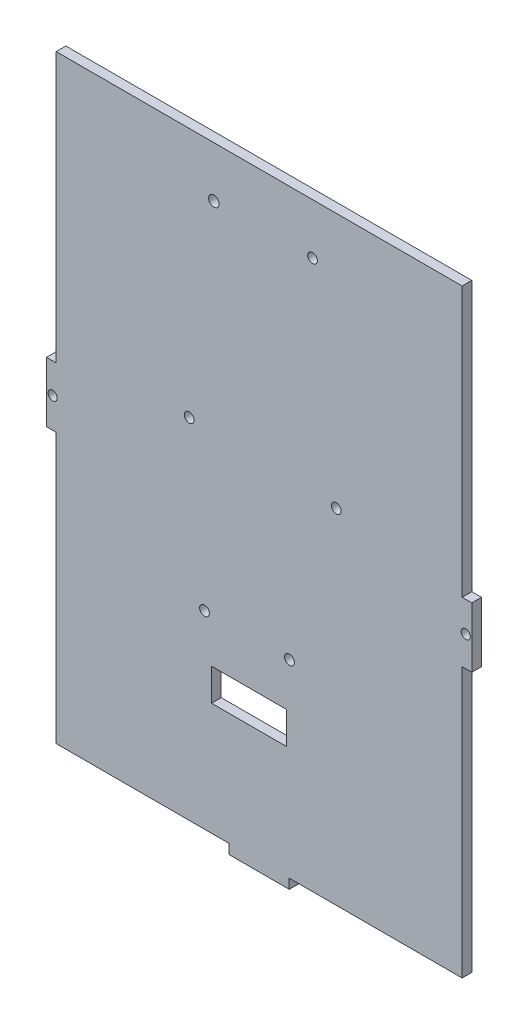
ISO-10303-21;
HEADER;
FILE_DESCRIPTION(('STEP AP214'),'2;1');
FILE_NAME('part.step','',(''),(''),'','','');
FILE_SCHEMA(('AUTOMOTIVE_DESIGN { 1 0 10303 214 1 1 1 1 }'));
ENDSEC;
DATA;
#1=APPLICATION_CONTEXT('core data for automotive mechanical design processes');
#2=APPLICATION_PROTOCOL_DEFINITION('international standard','automotive_design',2000,#1);
#3=PRODUCT_CONTEXT('',#1,'mechanical');
#4=PRODUCT('Part','Part','',(#3));
#5=PRODUCT_RELATED_PRODUCT_CATEGORY('part','',(#4));
#6=PRODUCT_DEFINITION_FORMATION('','',#4);
#7=PRODUCT_DEFINITION_CONTEXT('part definition',#1,'design');
#8=PRODUCT_DEFINITION('design','',#6,#7);
#9=PRODUCT_DEFINITION_SHAPE('','',#8);
#10=(LENGTH_UNIT() NAMED_UNIT(*) SI_UNIT(.MILLI.,.METRE.));
#11=(NAMED_UNIT(*) PLANE_ANGLE_UNIT() SI_UNIT($,.RADIAN.));
#12=(NAMED_UNIT(*) SI_UNIT($,.STERADIAN.) SOLID_ANGLE_UNIT());
#13=UNCERTAINTY_MEASURE_WITH_UNIT(LENGTH_MEASURE(1.E-05),#10,'distance_accuracy_value','');
#14=(GEOMETRIC_REPRESENTATION_CONTEXT(3) GLOBAL_UNCERTAINTY_ASSIGNED_CONTEXT((#13)) GLOBAL_UNIT_ASSIGNED_CONTEXT((#10,
#11,#12)) REPRESENTATION_CONTEXT('',''));
#15=CARTESIAN_POINT('',(0.,0.,0.));
#16=DIRECTION('',(0.,0.,1.));
#17=DIRECTION('',(1.,0.,0.));
#18=AXIS2_PLACEMENT_3D('',#15,#16,#17);
#19=CARTESIAN_POINT('',(69.85,101.6,3.18));
#20=DIRECTION('',(-1.,0.,0.));
#21=DIRECTION('',(0.,-1.,0.));
#22=AXIS2_PLACEMENT_3D('',#19,#20,#21);
#23=PLANE('',#22);
#24=DIRECTION('',(0.,1.,0.));
#25=VECTOR('',#24,1.);
#26=CARTESIAN_POINT('',(69.85,101.6,0.));
#27=LINE('',#26,#25);
#28=CARTESIAN_POINT('',(69.85,-9.875,0.));
#29=VERTEX_POINT('',#28);
#30=CARTESIAN_POINT('',(69.85,9.875,0.));
#31=VERTEX_POINT('',#30);
#32=EDGE_CURVE('E326',#29,#31,#27,.T.);
#33=ORIENTED_EDGE('',*,*,#32,.T.);
#34=DIRECTION('',(0.,0.,1.));
#35=VECTOR('',#34,1.);
#36=CARTESIAN_POINT('',(69.85,9.875,0.));
#37=LINE('',#36,#35);
#38=CARTESIAN_POINT('',(69.85,9.875,3.18));
#39=VERTEX_POINT('',#38);
#40=EDGE_CURVE('E349',#31,#39,#37,.T.);
#41=ORIENTED_EDGE('',*,*,#40,.T.);
#42=DIRECTION('',(0.,1.,0.));
#43=VECTOR('',#42,1.);
#44=CARTESIAN_POINT('',(69.85,101.6,3.18));
#45=LINE('',#44,#43);
#46=CARTESIAN_POINT('',(69.85,-9.875,3.18));
#47=VERTEX_POINT('',#46);
#48=EDGE_CURVE('E363',#47,#39,#45,.T.);
#49=ORIENTED_EDGE('',*,*,#48,.F.);
#50=DIRECTION('',(0.,0.,1.));
#51=VECTOR('',#50,1.);
#52=CARTESIAN_POINT('',(69.85,-9.875,0.));
#53=LINE('',#52,#51);
#54=EDGE_CURVE('E335',#29,#47,#53,.T.);
#55=ORIENTED_EDGE('',*,*,#54,.F.);
#56=EDGE_LOOP('',(#33,#41,#49,#55));
#57=FACE_BOUND('',#56,.T.);
#58=ADVANCED_FACE('F41',(#57),#23,.F.);
#59=CARTESIAN_POINT('',(-69.85,101.6,3.18));
#60=DIRECTION('',(1.,0.,0.));
#61=DIRECTION('',(0.,1.,0.));
#62=AXIS2_PLACEMENT_3D('',#59,#60,#61);
#63=PLANE('',#62);
#64=DIRECTION('',(0.,-1.,0.));
#65=VECTOR('',#64,1.);
#66=CARTESIAN_POINT('',(-69.85,101.6,3.18));
#67=LINE('',#66,#65);
#68=CARTESIAN_POINT('',(-69.85,9.875,3.18));
#69=VERTEX_POINT('',#68);
#70=CARTESIAN_POINT('',(-69.85,-9.875,3.18));
#71=VERTEX_POINT('',#70);
#72=EDGE_CURVE('E49',#69,#71,#67,.T.);
#73=ORIENTED_EDGE('',*,*,#72,.F.);
#74=DIRECTION('',(0.,0.,1.));
#75=VECTOR('',#74,1.);
#76=CARTESIAN_POINT('',(-69.85,9.875,0.));
#77=LINE('',#76,#75);
#78=CARTESIAN_POINT('',(-69.85,9.875,0.));
#79=VERTEX_POINT('',#78);
#80=EDGE_CURVE('E319',#79,#69,#77,.T.);
#81=ORIENTED_EDGE('',*,*,#80,.F.);
#82=DIRECTION('',(0.,-1.,0.));
#83=VECTOR('',#82,1.);
#84=CARTESIAN_POINT('',(-69.85,101.6,0.));
#85=LINE('',#84,#83);
#86=CARTESIAN_POINT('',(-69.85,-9.875,0.));
#87=VERTEX_POINT('',#86);
#88=EDGE_CURVE('E371',#79,#87,#85,.T.);
#89=ORIENTED_EDGE('',*,*,#88,.T.);
#90=DIRECTION('',(0.,0.,1.));
#91=VECTOR('',#90,1.);
#92=CARTESIAN_POINT('',(-69.85,-9.875,0.));
#93=LINE('',#92,#91);
#94=EDGE_CURVE('E300',#87,#71,#93,.T.);
#95=ORIENTED_EDGE('',*,*,#94,.T.);
#96=EDGE_LOOP('',(#73,#81,#89,#95));
#97=FACE_BOUND('',#96,.T.);
#98=ADVANCED_FACE('F433',(#97),#63,.F.);
#99=CARTESIAN_POINT('',(-69.85,-101.6,3.18));
#100=DIRECTION('',(0.,1.,0.));
#101=DIRECTION('',(0.,0.,1.));
#102=AXIS2_PLACEMENT_3D('',#99,#100,#101);
#103=PLANE('',#102);
#104=DIRECTION('',(1.,0.,0.));
#105=VECTOR('',#104,1.);
#106=CARTESIAN_POINT('',(-69.85,-101.6,3.18));
#107=LINE('',#106,#105);
#108=CARTESIAN_POINT('',(-9.87499999999999,-101.6,3.18));
#109=VERTEX_POINT('',#108);
#110=CARTESIAN_POINT('',(9.87500000000001,-101.6,3.18));
#111=VERTEX_POINT('',#110);
#112=EDGE_CURVE('E11',#109,#111,#107,.T.);
#113=ORIENTED_EDGE('',*,*,#112,.F.);
#114=DIRECTION('',(0.,0.,1.));
#115=VECTOR('',#114,1.);
#116=CARTESIAN_POINT('',(-9.87499999999999,-101.6,0.));
#117=LINE('',#116,#115);
#118=CARTESIAN_POINT('',(-9.87499999999999,-101.6,0.));
#119=VERTEX_POINT('',#118);
#120=EDGE_CURVE('E260',#119,#109,#117,.T.);
#121=ORIENTED_EDGE('',*,*,#120,.F.);
#122=DIRECTION('',(1.,0.,0.));
#123=VECTOR('',#122,1.);
#124=CARTESIAN_POINT('',(-69.85,-101.6,0.));
#125=LINE('',#124,#123);
#126=CARTESIAN_POINT('',(9.87500000000001,-101.6,0.));
#127=VERTEX_POINT('',#126);
#128=EDGE_CURVE('E366',#119,#127,#125,.T.);
#129=ORIENTED_EDGE('',*,*,#128,.T.);
#130=DIRECTION('',(0.,0.,1.));
#131=VECTOR('',#130,1.);
#132=CARTESIAN_POINT('',(9.87500000000001,-101.6,0.));
#133=LINE('',#132,#131);
#134=EDGE_CURVE('E264',#127,#111,#133,.T.);
#135=ORIENTED_EDGE('',*,*,#134,.T.);
#136=EDGE_LOOP('',(#113,#121,#129,#135));
#137=FACE_BOUND('',#136,.T.);
#138=ADVANCED_FACE('F393',(#137),#103,.F.);
#139=CARTESIAN_POINT('',(0.,0.,3.18));
#140=DIRECTION('',(0.,0.,1.));
#141=DIRECTION('',(1.,0.,0.));
#142=AXIS2_PLACEMENT_3D('',#139,#140,#141);
#143=PLANE('',#142);
#144=CARTESIAN_POINT('',(17.5238782385584,81.7973984042533,3.18));
#145=DIRECTION('',(0.,0.,1.));
#146=DIRECTION('',(1.,0.,0.));
#147=AXIS2_PLACEMENT_3D('',#144,#145,#146);
#148=CIRCLE('',#147,1.59000000000001);
#149=CARTESIAN_POINT('',(19.1138782385584,81.7973984042533,3.18));
#150=VERTEX_POINT('',#149);
#151=EDGE_CURVE('E377',#150,#150,#148,.T.);
#152=ORIENTED_EDGE('',*,*,#151,.F.);
#153=EDGE_LOOP('',(#152));
#154=FACE_BOUND('',#153,.T.);
#155=CARTESIAN_POINT('',(-14.8830919482617,81.7973984042533,3.18));
#156=DIRECTION('',(0.,0.,1.));
#157=DIRECTION('',(1.,0.,0.));
#158=AXIS2_PLACEMENT_3D('',#155,#156,#157);
#159=CIRCLE('',#158,1.71788268037511);
#160=CARTESIAN_POINT('',(-13.1652092678866,81.7973984042533,3.18));
#161=VERTEX_POINT('',#160);
#162=EDGE_CURVE('E203',#161,#161,#159,.T.);
#163=ORIENTED_EDGE('',*,*,#162,.F.);
#164=EDGE_LOOP('',(#163));
#165=FACE_BOUND('',#164,.T.);
#166=DIRECTION('',(0.,1.,0.));
#167=VECTOR('',#166,1.);
#168=CARTESIAN_POINT('',(8.92310875962821,-61.418139549545,3.18));
#169=LINE('',#168,#167);
#170=CARTESIAN_POINT('',(8.92310875962821,-61.418139549545,3.18));
#171=VERTEX_POINT('',#170);
#172=CARTESIAN_POINT('',(8.92310875962821,-50.8809258858847,3.18));
#173=VERTEX_POINT('',#172);
#174=EDGE_CURVE('E57',#171,#173,#169,.T.);
#175=ORIENTED_EDGE('',*,*,#174,.F.);
#176=DIRECTION('',(1.,0.,0.));
#177=VECTOR('',#176,1.);
#178=CARTESIAN_POINT('',(8.92310875962821,-61.418139549545,3.18));
#179=LINE('',#178,#177);
#180=CARTESIAN_POINT('',(-15.6426883360048,-61.418139549545,3.18));
#181=VERTEX_POINT('',#180);
#182=EDGE_CURVE('E197',#181,#171,#179,.T.);
#183=ORIENTED_EDGE('',*,*,#182,.F.);
#184=DIRECTION('',(0.,-1.,0.));
#185=VECTOR('',#184,1.);
#186=CARTESIAN_POINT('',(-15.6426883360048,-61.418139549545,3.18));
#187=LINE('',#186,#185);
#188=CARTESIAN_POINT('',(-15.6426883360048,-50.8809258858847,3.18));
#189=VERTEX_POINT('',#188);
#190=EDGE_CURVE('E200',#189,#181,#187,.T.);
#191=ORIENTED_EDGE('',*,*,#190,.F.);
#192=DIRECTION('',(-1.,0.,0.));
#193=VECTOR('',#192,1.);
#194=CARTESIAN_POINT('',(8.92310875962821,-50.8809258858847,3.18));
#195=LINE('',#194,#193);
#196=EDGE_CURVE('E209',#173,#189,#195,.T.);
#197=ORIENTED_EDGE('',*,*,#196,.F.);
#198=EDGE_LOOP('',(#175,#183,#191,#197));
#199=FACE_BOUND('',#198,.T.);
#200=CARTESIAN_POINT('',(9.95203788787976,-36.2496226597615,3.18));
#201=DIRECTION('',(0.,0.,1.));
#202=DIRECTION('',(1.,0.,0.));
#203=AXIS2_PLACEMENT_3D('',#200,#201,#202);
#204=CIRCLE('',#203,1.6);
#205=CARTESIAN_POINT('',(11.5520378878798,-36.2496226597615,3.18));
#206=VERTEX_POINT('',#205);
#207=EDGE_CURVE('E215',#206,#206,#204,.T.);
#208=ORIENTED_EDGE('',*,*,#207,.F.);
#209=EDGE_LOOP('',(#208));
#210=FACE_BOUND('',#209,.T.);
#211=CARTESIAN_POINT('',(-22.9642584988605,16.2029981725693,3.18));
#212=DIRECTION('',(0.,0.,1.));
#213=DIRECTION('',(1.,0.,0.));
#214=AXIS2_PLACEMENT_3D('',#211,#212,#213);
#215=CIRCLE('',#214,1.6);
#216=CARTESIAN_POINT('',(-21.3642584988605,16.2029981725693,3.18));
#217=VERTEX_POINT('',#216);
#218=EDGE_CURVE('E229',#217,#217,#215,.T.);
#219=ORIENTED_EDGE('',*,*,#218,.F.);
#220=EDGE_LOOP('',(#219));
#221=FACE_BOUND('',#220,.T.);
#222=CARTESIAN_POINT('',(25.3331253887636,14.5258846965433,3.18));
#223=DIRECTION('',(0.,0.,1.));
#224=DIRECTION('',(1.,0.,0.));
#225=AXIS2_PLACEMENT_3D('',#222,#223,#224);
#226=CIRCLE('',#225,1.6);
#227=CARTESIAN_POINT('',(26.9331253887636,14.5258846965433,3.18));
#228=VERTEX_POINT('',#227);
#229=EDGE_CURVE('E223',#228,#228,#226,.T.);
#230=ORIENTED_EDGE('',*,*,#229,.F.);
#231=EDGE_LOOP('',(#230));
#232=FACE_BOUND('',#231,.T.);
#233=CARTESIAN_POINT('',(-17.9479265519563,-36.205077672652,3.18));
#234=DIRECTION('',(0.,0.,1.));
#235=DIRECTION('',(1.,0.,0.));
#236=AXIS2_PLACEMENT_3D('',#233,#234,#235);
#237=CIRCLE('',#236,1.6);
#238=CARTESIAN_POINT('',(-16.3479265519563,-36.205077672652,3.18));
#239=VERTEX_POINT('',#238);
#240=EDGE_CURVE('E222',#239,#239,#237,.T.);
#241=ORIENTED_EDGE('',*,*,#240,.F.);
#242=EDGE_LOOP('',(#241));
#243=FACE_BOUND('',#242,.T.);
#244=DIRECTION('',(1.,0.,0.));
#245=VECTOR('',#244,1.);
#246=CARTESIAN_POINT('',(66.67,98.4200000000002,3.18));
#247=LINE('',#246,#245);
#248=CARTESIAN_POINT('',(-66.67,98.4200000000002,3.18));
#249=VERTEX_POINT('',#248);
#250=CARTESIAN_POINT('',(66.67,98.4200000000002,3.18));
#251=VERTEX_POINT('',#250);
#252=EDGE_CURVE('E240',#249,#251,#247,.T.);
#253=ORIENTED_EDGE('',*,*,#252,.F.);
#254=DIRECTION('',(0.,1.,0.));
#255=VECTOR('',#254,1.);
#256=CARTESIAN_POINT('',(-66.67,101.6,3.18));
#257=LINE('',#256,#255);
#258=CARTESIAN_POINT('',(-66.67,9.875,3.18));
#259=VERTEX_POINT('',#258);
#260=EDGE_CURVE('E316',#259,#249,#257,.T.);
#261=ORIENTED_EDGE('',*,*,#260,.F.);
#262=DIRECTION('',(1.,0.,0.));
#263=VECTOR('',#262,1.);
#264=CARTESIAN_POINT('',(-69.85,9.875,3.18));
#265=LINE('',#264,#263);
#266=EDGE_CURVE('E303',#69,#259,#265,.T.);
#267=ORIENTED_EDGE('',*,*,#266,.F.);
#268=ORIENTED_EDGE('',*,*,#72,.T.);
#269=DIRECTION('',(-1.,0.,0.));
#270=VECTOR('',#269,1.);
#271=CARTESIAN_POINT('',(-69.85,-9.875,3.18));
#272=LINE('',#271,#270);
#273=CARTESIAN_POINT('',(-66.67,-9.87499999999999,3.18));
#274=VERTEX_POINT('',#273);
#275=EDGE_CURVE('E292',#274,#71,#272,.T.);
#276=ORIENTED_EDGE('',*,*,#275,.F.);
#277=DIRECTION('',(0.,1.,0.));
#278=VECTOR('',#277,1.);
#279=CARTESIAN_POINT('',(-66.67,-101.6,3.18));
#280=LINE('',#279,#278);
#281=CARTESIAN_POINT('',(-66.67,-98.42,3.18));
#282=VERTEX_POINT('',#281);
#283=EDGE_CURVE('E296',#282,#274,#280,.T.);
#284=ORIENTED_EDGE('',*,*,#283,.F.);
#285=DIRECTION('',(-1.,0.,0.));
#286=VECTOR('',#285,1.);
#287=CARTESIAN_POINT('',(-66.67,-98.42,3.18));
#288=LINE('',#287,#286);
#289=CARTESIAN_POINT('',(-9.87499999999999,-98.42,3.18));
#290=VERTEX_POINT('',#289);
#291=EDGE_CURVE('E257',#290,#282,#288,.T.);
#292=ORIENTED_EDGE('',*,*,#291,.F.);
#293=DIRECTION('',(0.,1.,0.));
#294=VECTOR('',#293,1.);
#295=CARTESIAN_POINT('',(-9.87499999999999,-101.6,3.18));
#296=LINE('',#295,#294);
#297=EDGE_CURVE('E261',#109,#290,#296,.T.);
#298=ORIENTED_EDGE('',*,*,#297,.F.);
#299=ORIENTED_EDGE('',*,*,#112,.T.);
#300=DIRECTION('',(0.,-1.,0.));
#301=VECTOR('',#300,1.);
#302=CARTESIAN_POINT('',(9.87500000000001,-101.6,3.18));
#303=LINE('',#302,#301);
#304=CARTESIAN_POINT('',(9.87500000000001,-98.42,3.18));
#305=VERTEX_POINT('',#304);
#306=EDGE_CURVE('E277',#305,#111,#303,.T.);
#307=ORIENTED_EDGE('',*,*,#306,.F.);
#308=DIRECTION('',(-1.,0.,0.));
#309=VECTOR('',#308,1.);
#310=CARTESIAN_POINT('',(66.67,-98.42,3.18));
#311=LINE('',#310,#309);
#312=CARTESIAN_POINT('',(66.67,-98.42,3.18));
#313=VERTEX_POINT('',#312);
#314=EDGE_CURVE('E251',#313,#305,#311,.T.);
#315=ORIENTED_EDGE('',*,*,#314,.F.);
#316=DIRECTION('',(0.,-1.,0.));
#317=VECTOR('',#316,1.);
#318=CARTESIAN_POINT('',(66.67,-101.6,3.18));
#319=LINE('',#318,#317);
#320=CARTESIAN_POINT('',(66.67,-9.87499999999999,3.18));
#321=VERTEX_POINT('',#320);
#322=EDGE_CURVE('E332',#321,#313,#319,.T.);
#323=ORIENTED_EDGE('',*,*,#322,.F.);
#324=DIRECTION('',(-1.,0.,0.));
#325=VECTOR('',#324,1.);
#326=CARTESIAN_POINT('',(69.85,-9.875,3.18));
#327=LINE('',#326,#325);
#328=EDGE_CURVE('E336',#47,#321,#327,.T.);
#329=ORIENTED_EDGE('',*,*,#328,.F.);
#330=ORIENTED_EDGE('',*,*,#48,.T.);
#331=DIRECTION('',(1.,0.,0.));
#332=VECTOR('',#331,1.);
#333=CARTESIAN_POINT('',(69.85,9.875,3.18));
#334=LINE('',#333,#332);
#335=CARTESIAN_POINT('',(66.67,9.875,3.18));
#336=VERTEX_POINT('',#335);
#337=EDGE_CURVE('E353',#336,#39,#334,.T.);
#338=ORIENTED_EDGE('',*,*,#337,.F.);
#339=DIRECTION('',(0.,-1.,0.));
#340=VECTOR('',#339,1.);
#341=CARTESIAN_POINT('',(66.67,101.6,3.18));
#342=LINE('',#341,#340);
#343=EDGE_CURVE('E269',#251,#336,#342,.T.);
#344=ORIENTED_EDGE('',*,*,#343,.F.);
#345=EDGE_LOOP('',(#253,#261,#267,#268,#276,#284,#292,#298,#299,#307,#315,#323,#329,#330,#338,#344));
#346=FACE_BOUND('',#345,.T.);
#347=CARTESIAN_POINT('',(67.85,0.,3.18));
#348=DIRECTION('',(0.,0.,1.));
#349=DIRECTION('',(-1.,0.,0.));
#350=AXIS2_PLACEMENT_3D('',#347,#348,#349);
#351=CIRCLE('',#350,1.5);
#352=CARTESIAN_POINT('',(66.35,0.,3.18));
#353=VERTEX_POINT('',#352);
#354=EDGE_CURVE('E346',#353,#353,#351,.T.);
#355=ORIENTED_EDGE('',*,*,#354,.F.);
#356=EDGE_LOOP('',(#355));
#357=FACE_BOUND('',#356,.T.);
#358=CARTESIAN_POINT('',(-67.85,0.,3.18));
#359=DIRECTION('',(0.,0.,1.));
#360=DIRECTION('',(1.,0.,0.));
#361=AXIS2_PLACEMENT_3D('',#358,#359,#360);
#362=CIRCLE('',#361,1.5);
#363=CARTESIAN_POINT('',(-66.35,0.,3.18));
#364=VERTEX_POINT('',#363);
#365=EDGE_CURVE('E308',#364,#364,#362,.T.);
#366=ORIENTED_EDGE('',*,*,#365,.F.);
#367=EDGE_LOOP('',(#366));
#368=FACE_BOUND('',#367,.T.);
#369=ADVANCED_FACE('F390',(#154,#165,#199,#210,#221,#232,#243,#346,#357,#368),#143,.T.);
#370=CARTESIAN_POINT('',(0.,0.,0.));
#371=DIRECTION('',(0.,0.,1.));
#372=DIRECTION('',(1.,0.,0.));
#373=AXIS2_PLACEMENT_3D('',#370,#371,#372);
#374=PLANE('',#373);
#375=CARTESIAN_POINT('',(17.5238782385584,81.7973984042533,0.));
#376=DIRECTION('',(0.,0.,1.));
#377=DIRECTION('',(1.,0.,0.));
#378=AXIS2_PLACEMENT_3D('',#375,#376,#377);
#379=CIRCLE('',#378,1.59000000000001);
#380=CARTESIAN_POINT('',(19.1138782385584,81.7973984042533,0.));
#381=VERTEX_POINT('',#380);
#382=EDGE_CURVE('E44',#381,#381,#379,.T.);
#383=ORIENTED_EDGE('',*,*,#382,.T.);
#384=EDGE_LOOP('',(#383));
#385=FACE_BOUND('',#384,.T.);
#386=CARTESIAN_POINT('',(-14.8830919482617,81.7973984042533,0.));
#387=DIRECTION('',(0.,0.,1.));
#388=DIRECTION('',(1.,0.,0.));
#389=AXIS2_PLACEMENT_3D('',#386,#387,#388);
#390=CIRCLE('',#389,1.71788268037511);
#391=CARTESIAN_POINT('',(-13.1652092678866,81.7973984042533,0.));
#392=VERTEX_POINT('',#391);
#393=EDGE_CURVE('E375',#392,#392,#390,.T.);
#394=ORIENTED_EDGE('',*,*,#393,.T.);
#395=EDGE_LOOP('',(#394));
#396=FACE_BOUND('',#395,.T.);
#397=DIRECTION('',(1.,0.,0.));
#398=VECTOR('',#397,1.);
#399=CARTESIAN_POINT('',(8.92310875962821,-61.418139549545,0.));
#400=LINE('',#399,#398);
#401=CARTESIAN_POINT('',(-15.6426883360048,-61.418139549545,0.));
#402=VERTEX_POINT('',#401);
#403=CARTESIAN_POINT('',(8.92310875962821,-61.418139549545,0.));
#404=VERTEX_POINT('',#403);
#405=EDGE_CURVE('E187',#402,#404,#400,.T.);
#406=ORIENTED_EDGE('',*,*,#405,.T.);
#407=DIRECTION('',(0.,1.,0.));
#408=VECTOR('',#407,1.);
#409=CARTESIAN_POINT('',(8.92310875962821,-61.418139549545,0.));
#410=LINE('',#409,#408);
#411=CARTESIAN_POINT('',(8.92310875962821,-50.8809258858847,0.));
#412=VERTEX_POINT('',#411);
#413=EDGE_CURVE('E181',#404,#412,#410,.T.);
#414=ORIENTED_EDGE('',*,*,#413,.T.);
#415=DIRECTION('',(-1.,0.,0.));
#416=VECTOR('',#415,1.);
#417=CARTESIAN_POINT('',(8.92310875962821,-50.8809258858847,0.));
#418=LINE('',#417,#416);
#419=CARTESIAN_POINT('',(-15.6426883360048,-50.8809258858847,0.));
#420=VERTEX_POINT('',#419);
#421=EDGE_CURVE('E190',#412,#420,#418,.T.);
#422=ORIENTED_EDGE('',*,*,#421,.T.);
#423=DIRECTION('',(0.,-1.,0.));
#424=VECTOR('',#423,1.);
#425=CARTESIAN_POINT('',(-15.6426883360048,-61.418139549545,0.));
#426=LINE('',#425,#424);
#427=EDGE_CURVE('E65',#420,#402,#426,.T.);
#428=ORIENTED_EDGE('',*,*,#427,.T.);
#429=EDGE_LOOP('',(#406,#414,#422,#428));
#430=FACE_BOUND('',#429,.T.);
#431=CARTESIAN_POINT('',(9.95203788787976,-36.2496226597615,0.));
#432=DIRECTION('',(0.,0.,1.));
#433=DIRECTION('',(1.,0.,0.));
#434=AXIS2_PLACEMENT_3D('',#431,#432,#433);
#435=CIRCLE('',#434,1.6);
#436=CARTESIAN_POINT('',(11.5520378878798,-36.2496226597615,0.));
#437=VERTEX_POINT('',#436);
#438=EDGE_CURVE('E232',#437,#437,#435,.T.);
#439=ORIENTED_EDGE('',*,*,#438,.T.);
#440=EDGE_LOOP('',(#439));
#441=FACE_BOUND('',#440,.T.);
#442=CARTESIAN_POINT('',(-22.9642584988605,16.2029981725693,0.));
#443=DIRECTION('',(0.,0.,1.));
#444=DIRECTION('',(1.,0.,0.));
#445=AXIS2_PLACEMENT_3D('',#442,#443,#444);
#446=CIRCLE('',#445,1.6);
#447=CARTESIAN_POINT('',(-21.3642584988605,16.2029981725693,0.));
#448=VERTEX_POINT('',#447);
#449=EDGE_CURVE('E226',#448,#448,#446,.T.);
#450=ORIENTED_EDGE('',*,*,#449,.T.);
#451=EDGE_LOOP('',(#450));
#452=FACE_BOUND('',#451,.T.);
#453=CARTESIAN_POINT('',(25.3331253887636,14.5258846965433,0.));
#454=DIRECTION('',(0.,0.,1.));
#455=DIRECTION('',(1.,0.,0.));
#456=AXIS2_PLACEMENT_3D('',#453,#454,#455);
#457=CIRCLE('',#456,1.6);
#458=CARTESIAN_POINT('',(26.9331253887636,14.5258846965433,0.));
#459=VERTEX_POINT('',#458);
#460=EDGE_CURVE('E219',#459,#459,#457,.T.);
#461=ORIENTED_EDGE('',*,*,#460,.T.);
#462=EDGE_LOOP('',(#461));
#463=FACE_BOUND('',#462,.T.);
#464=CARTESIAN_POINT('',(-17.9479265519563,-36.205077672652,0.));
#465=DIRECTION('',(0.,0.,1.));
#466=DIRECTION('',(1.,0.,0.));
#467=AXIS2_PLACEMENT_3D('',#464,#465,#466);
#468=CIRCLE('',#467,1.6);
#469=CARTESIAN_POINT('',(-16.3479265519563,-36.205077672652,0.));
#470=VERTEX_POINT('',#469);
#471=EDGE_CURVE('E237',#470,#470,#468,.T.);
#472=ORIENTED_EDGE('',*,*,#471,.T.);
#473=EDGE_LOOP('',(#472));
#474=FACE_BOUND('',#473,.T.);
#475=DIRECTION('',(0.,1.,0.));
#476=VECTOR('',#475,1.);
#477=CARTESIAN_POINT('',(-66.67,101.6,0.));
#478=LINE('',#477,#476);
#479=CARTESIAN_POINT('',(-66.67,9.875,0.));
#480=VERTEX_POINT('',#479);
#481=CARTESIAN_POINT('',(-66.67,98.4200000000002,0.));
#482=VERTEX_POINT('',#481);
#483=EDGE_CURVE('E315',#480,#482,#478,.T.);
#484=ORIENTED_EDGE('',*,*,#483,.T.);
#485=DIRECTION('',(1.,0.,0.));
#486=VECTOR('',#485,1.);
#487=CARTESIAN_POINT('',(66.67,98.4200000000002,0.));
#488=LINE('',#487,#486);
#489=CARTESIAN_POINT('',(66.67,98.4200000000002,0.));
#490=VERTEX_POINT('',#489);
#491=EDGE_CURVE('E243',#482,#490,#488,.T.);
#492=ORIENTED_EDGE('',*,*,#491,.T.);
#493=DIRECTION('',(0.,-1.,0.));
#494=VECTOR('',#493,1.);
#495=CARTESIAN_POINT('',(66.67,101.6,0.));
#496=LINE('',#495,#494);
#497=CARTESIAN_POINT('',(66.67,9.875,0.));
#498=VERTEX_POINT('',#497);
#499=EDGE_CURVE('E350',#490,#498,#496,.T.);
#500=ORIENTED_EDGE('',*,*,#499,.T.);
#501=DIRECTION('',(1.,0.,0.));
#502=VECTOR('',#501,1.);
#503=CARTESIAN_POINT('',(69.85,9.875,0.));
#504=LINE('',#503,#502);
#505=EDGE_CURVE('E352',#498,#31,#504,.T.);
#506=ORIENTED_EDGE('',*,*,#505,.T.);
#507=ORIENTED_EDGE('',*,*,#32,.F.);
#508=DIRECTION('',(-1.,0.,0.));
#509=VECTOR('',#508,1.);
#510=CARTESIAN_POINT('',(69.85,-9.875,0.));
#511=LINE('',#510,#509);
#512=CARTESIAN_POINT('',(66.67,-9.87499999999999,0.));
#513=VERTEX_POINT('',#512);
#514=EDGE_CURVE('E328',#29,#513,#511,.T.);
#515=ORIENTED_EDGE('',*,*,#514,.T.);
#516=DIRECTION('',(0.,-1.,0.));
#517=VECTOR('',#516,1.);
#518=CARTESIAN_POINT('',(66.67,-101.6,0.));
#519=LINE('',#518,#517);
#520=CARTESIAN_POINT('',(66.67,-98.42,0.));
#521=VERTEX_POINT('',#520);
#522=EDGE_CURVE('E331',#513,#521,#519,.T.);
#523=ORIENTED_EDGE('',*,*,#522,.T.);
#524=DIRECTION('',(-1.,0.,0.));
#525=VECTOR('',#524,1.);
#526=CARTESIAN_POINT('',(66.67,-98.42,0.));
#527=LINE('',#526,#525);
#528=CARTESIAN_POINT('',(9.87500000000001,-98.42,0.));
#529=VERTEX_POINT('',#528);
#530=EDGE_CURVE('E273',#521,#529,#527,.T.);
#531=ORIENTED_EDGE('',*,*,#530,.T.);
#532=DIRECTION('',(0.,-1.,0.));
#533=VECTOR('',#532,1.);
#534=CARTESIAN_POINT('',(9.87500000000001,-101.6,0.));
#535=LINE('',#534,#533);
#536=EDGE_CURVE('E276',#529,#127,#535,.T.);
#537=ORIENTED_EDGE('',*,*,#536,.T.);
#538=ORIENTED_EDGE('',*,*,#128,.F.);
#539=DIRECTION('',(0.,1.,0.));
#540=VECTOR('',#539,1.);
#541=CARTESIAN_POINT('',(-9.87499999999999,-101.6,0.));
#542=LINE('',#541,#540);
#543=CARTESIAN_POINT('',(-9.87499999999999,-98.42,0.));
#544=VERTEX_POINT('',#543);
#545=EDGE_CURVE('E253',#119,#544,#542,.T.);
#546=ORIENTED_EDGE('',*,*,#545,.T.);
#547=DIRECTION('',(-1.,0.,0.));
#548=VECTOR('',#547,1.);
#549=CARTESIAN_POINT('',(-66.67,-98.42,0.));
#550=LINE('',#549,#548);
#551=CARTESIAN_POINT('',(-66.67,-98.42,0.));
#552=VERTEX_POINT('',#551);
#553=EDGE_CURVE('E256',#544,#552,#550,.T.);
#554=ORIENTED_EDGE('',*,*,#553,.T.);
#555=DIRECTION('',(0.,1.,0.));
#556=VECTOR('',#555,1.);
#557=CARTESIAN_POINT('',(-66.67,-101.6,0.));
#558=LINE('',#557,#556);
#559=CARTESIAN_POINT('',(-66.67,-9.87499999999999,0.));
#560=VERTEX_POINT('',#559);
#561=EDGE_CURVE('E289',#552,#560,#558,.T.);
#562=ORIENTED_EDGE('',*,*,#561,.T.);
#563=DIRECTION('',(-1.,0.,0.));
#564=VECTOR('',#563,1.);
#565=CARTESIAN_POINT('',(-69.85,-9.875,0.));
#566=LINE('',#565,#564);
#567=EDGE_CURVE('E291',#560,#87,#566,.T.);
#568=ORIENTED_EDGE('',*,*,#567,.T.);
#569=ORIENTED_EDGE('',*,*,#88,.F.);
#570=DIRECTION('',(1.,0.,0.));
#571=VECTOR('',#570,1.);
#572=CARTESIAN_POINT('',(-69.85,9.875,0.));
#573=LINE('',#572,#571);
#574=EDGE_CURVE('E312',#79,#480,#573,.T.);
#575=ORIENTED_EDGE('',*,*,#574,.T.);
#576=EDGE_LOOP('',(#484,#492,#500,#506,#507,#515,#523,#531,#537,#538,#546,#554,#562,#568,#569,#575));
#577=FACE_BOUND('',#576,.T.);
#578=CARTESIAN_POINT('',(67.85,0.,0.));
#579=DIRECTION('',(0.,0.,1.));
#580=DIRECTION('',(-1.,0.,0.));
#581=AXIS2_PLACEMENT_3D('',#578,#579,#580);
#582=CIRCLE('',#581,1.5);
#583=CARTESIAN_POINT('',(66.35,0.,0.));
#584=VERTEX_POINT('',#583);
#585=EDGE_CURVE('E339',#584,#584,#582,.T.);
#586=ORIENTED_EDGE('',*,*,#585,.T.);
#587=EDGE_LOOP('',(#586));
#588=FACE_BOUND('',#587,.T.);
#589=CARTESIAN_POINT('',(-67.85,0.,0.));
#590=DIRECTION('',(0.,0.,1.));
#591=DIRECTION('',(1.,0.,0.));
#592=AXIS2_PLACEMENT_3D('',#589,#590,#591);
#593=CIRCLE('',#592,1.5);
#594=CARTESIAN_POINT('',(-66.35,0.,0.));
#595=VERTEX_POINT('',#594);
#596=EDGE_CURVE('E298',#595,#595,#593,.T.);
#597=ORIENTED_EDGE('',*,*,#596,.T.);
#598=EDGE_LOOP('',(#597));
#599=FACE_BOUND('',#598,.T.);
#600=ADVANCED_FACE('F194',(#385,#396,#430,#441,#452,#463,#474,#577,#588,#599),#374,.F.);
#601=CARTESIAN_POINT('',(-67.85,0.,0.));
#602=DIRECTION('',(0.,0.,1.));
#603=DIRECTION('',(1.,0.,0.));
#604=AXIS2_PLACEMENT_3D('',#601,#602,#603);
#605=CYLINDRICAL_SURFACE('',#604,1.5);
#606=ORIENTED_EDGE('',*,*,#596,.F.);
#607=EDGE_LOOP('',(#606));
#608=FACE_BOUND('',#607,.T.);
#609=ORIENTED_EDGE('',*,*,#365,.T.);
#610=EDGE_LOOP('',(#609));
#611=FACE_BOUND('',#610,.T.);
#612=ADVANCED_FACE('F414',(#608,#611),#605,.F.);
#613=CARTESIAN_POINT('',(-69.85,-9.875,0.));
#614=DIRECTION('',(0.,1.,0.));
#615=DIRECTION('',(-1.,0.,0.));
#616=AXIS2_PLACEMENT_3D('',#613,#614,#615);
#617=PLANE('',#616);
#618=ORIENTED_EDGE('',*,*,#275,.T.);
#619=ORIENTED_EDGE('',*,*,#94,.F.);
#620=ORIENTED_EDGE('',*,*,#567,.F.);
#621=DIRECTION('',(0.,0.,1.));
#622=VECTOR('',#621,1.);
#623=CARTESIAN_POINT('',(-66.67,-9.87499999999999,0.));
#624=LINE('',#623,#622);
#625=EDGE_CURVE('E295',#560,#274,#624,.T.);
#626=ORIENTED_EDGE('',*,*,#625,.T.);
#627=EDGE_LOOP('',(#618,#619,#620,#626));
#628=FACE_BOUND('',#627,.T.);
#629=ADVANCED_FACE('F416',(#628),#617,.F.);
#630=CARTESIAN_POINT('',(-66.67,-101.6,0.));
#631=DIRECTION('',(1.,0.,0.));
#632=DIRECTION('',(0.,0.,-1.));
#633=AXIS2_PLACEMENT_3D('',#630,#631,#632);
#634=PLANE('',#633);
#635=ORIENTED_EDGE('',*,*,#561,.F.);
#636=DIRECTION('',(0.,0.,1.));
#637=VECTOR('',#636,1.);
#638=CARTESIAN_POINT('',(-66.67,-98.42,0.));
#639=LINE('',#638,#637);
#640=EDGE_CURVE('E266',#552,#282,#639,.T.);
#641=ORIENTED_EDGE('',*,*,#640,.T.);
#642=ORIENTED_EDGE('',*,*,#283,.T.);
#643=ORIENTED_EDGE('',*,*,#625,.F.);
#644=EDGE_LOOP('',(#635,#641,#642,#643));
#645=FACE_BOUND('',#644,.T.);
#646=ADVANCED_FACE('F423',(#645),#634,.F.);
#647=CARTESIAN_POINT('',(-66.67,101.6,0.));
#648=DIRECTION('',(1.,0.,0.));
#649=DIRECTION('',(0.,1.,0.));
#650=AXIS2_PLACEMENT_3D('',#647,#648,#649);
#651=PLANE('',#650);
#652=ORIENTED_EDGE('',*,*,#260,.T.);
#653=DIRECTION('',(0.,0.,1.));
#654=VECTOR('',#653,1.);
#655=CARTESIAN_POINT('',(-66.67,98.4200000000002,0.));
#656=LINE('',#655,#654);
#657=EDGE_CURVE('E246',#482,#249,#656,.T.);
#658=ORIENTED_EDGE('',*,*,#657,.F.);
#659=ORIENTED_EDGE('',*,*,#483,.F.);
#660=DIRECTION('',(0.,0.,1.));
#661=VECTOR('',#660,1.);
#662=CARTESIAN_POINT('',(-66.67,9.875,0.));
#663=LINE('',#662,#661);
#664=EDGE_CURVE('E324',#480,#259,#663,.T.);
#665=ORIENTED_EDGE('',*,*,#664,.T.);
#666=EDGE_LOOP('',(#652,#658,#659,#665));
#667=FACE_BOUND('',#666,.T.);
#668=ADVANCED_FACE('F490',(#667),#651,.F.);
#669=CARTESIAN_POINT('',(-69.85,9.875,0.));
#670=DIRECTION('',(0.,-1.,0.));
#671=DIRECTION('',(1.,0.,0.));
#672=AXIS2_PLACEMENT_3D('',#669,#670,#671);
#673=PLANE('',#672);
#674=ORIENTED_EDGE('',*,*,#266,.T.);
#675=ORIENTED_EDGE('',*,*,#664,.F.);
#676=ORIENTED_EDGE('',*,*,#574,.F.);
#677=ORIENTED_EDGE('',*,*,#80,.T.);
#678=EDGE_LOOP('',(#674,#675,#676,#677));
#679=FACE_BOUND('',#678,.T.);
#680=ADVANCED_FACE('F488',(#679),#673,.F.);
#681=CARTESIAN_POINT('',(66.67,-101.6,0.));
#682=DIRECTION('',(-1.,0.,0.));
#683=DIRECTION('',(0.,0.,1.));
#684=AXIS2_PLACEMENT_3D('',#681,#682,#683);
#685=PLANE('',#684);
#686=ORIENTED_EDGE('',*,*,#322,.T.);
#687=DIRECTION('',(0.,0.,1.));
#688=VECTOR('',#687,1.);
#689=CARTESIAN_POINT('',(66.67,-98.42,0.));
#690=LINE('',#689,#688);
#691=EDGE_CURVE('E280',#521,#313,#690,.T.);
#692=ORIENTED_EDGE('',*,*,#691,.F.);
#693=ORIENTED_EDGE('',*,*,#522,.F.);
#694=DIRECTION('',(0.,0.,1.));
#695=VECTOR('',#694,1.);
#696=CARTESIAN_POINT('',(66.67,-9.87499999999999,0.));
#697=LINE('',#696,#695);
#698=EDGE_CURVE('E311',#513,#321,#697,.T.);
#699=ORIENTED_EDGE('',*,*,#698,.T.);
#700=EDGE_LOOP('',(#686,#692,#693,#699));
#701=FACE_BOUND('',#700,.T.);
#702=ADVANCED_FACE('F458',(#701),#685,.F.);
#703=CARTESIAN_POINT('',(69.85,-9.875,0.));
#704=DIRECTION('',(0.,1.,0.));
#705=DIRECTION('',(-1.,0.,0.));
#706=AXIS2_PLACEMENT_3D('',#703,#704,#705);
#707=PLANE('',#706);
#708=ORIENTED_EDGE('',*,*,#328,.T.);
#709=ORIENTED_EDGE('',*,*,#698,.F.);
#710=ORIENTED_EDGE('',*,*,#514,.F.);
#711=ORIENTED_EDGE('',*,*,#54,.T.);
#712=EDGE_LOOP('',(#708,#709,#710,#711));
#713=FACE_BOUND('',#712,.T.);
#714=ADVANCED_FACE('F456',(#713),#707,.F.);
#715=CARTESIAN_POINT('',(67.85,0.,0.));
#716=DIRECTION('',(0.,0.,1.));
#717=DIRECTION('',(1.,0.,0.));
#718=AXIS2_PLACEMENT_3D('',#715,#716,#717);
#719=CYLINDRICAL_SURFACE('',#718,1.5);
#720=ORIENTED_EDGE('',*,*,#585,.F.);
#721=EDGE_LOOP('',(#720));
#722=FACE_BOUND('',#721,.T.);
#723=ORIENTED_EDGE('',*,*,#354,.T.);
#724=EDGE_LOOP('',(#723));
#725=FACE_BOUND('',#724,.T.);
#726=ADVANCED_FACE('F529',(#722,#725),#719,.F.);
#727=CARTESIAN_POINT('',(69.85,9.875,0.));
#728=DIRECTION('',(0.,-1.,0.));
#729=DIRECTION('',(1.,0.,0.));
#730=AXIS2_PLACEMENT_3D('',#727,#728,#729);
#731=PLANE('',#730);
#732=ORIENTED_EDGE('',*,*,#337,.T.);
#733=ORIENTED_EDGE('',*,*,#40,.F.);
#734=ORIENTED_EDGE('',*,*,#505,.F.);
#735=DIRECTION('',(0.,0.,1.));
#736=VECTOR('',#735,1.);
#737=CARTESIAN_POINT('',(66.67,9.875,0.));
#738=LINE('',#737,#736);
#739=EDGE_CURVE('E356',#498,#336,#738,.T.);
#740=ORIENTED_EDGE('',*,*,#739,.T.);
#741=EDGE_LOOP('',(#732,#733,#734,#740));
#742=FACE_BOUND('',#741,.T.);
#743=ADVANCED_FACE('F447',(#742),#731,.F.);
#744=CARTESIAN_POINT('',(66.67,101.6,0.));
#745=DIRECTION('',(-1.,0.,0.));
#746=DIRECTION('',(0.,-1.,0.));
#747=AXIS2_PLACEMENT_3D('',#744,#745,#746);
#748=PLANE('',#747);
#749=ORIENTED_EDGE('',*,*,#499,.F.);
#750=DIRECTION('',(0.,0.,1.));
#751=VECTOR('',#750,1.);
#752=CARTESIAN_POINT('',(66.67,98.4200000000002,0.));
#753=LINE('',#752,#751);
#754=EDGE_CURVE('E248',#490,#251,#753,.T.);
#755=ORIENTED_EDGE('',*,*,#754,.T.);
#756=ORIENTED_EDGE('',*,*,#343,.T.);
#757=ORIENTED_EDGE('',*,*,#739,.F.);
#758=EDGE_LOOP('',(#749,#755,#756,#757));
#759=FACE_BOUND('',#758,.T.);
#760=ADVANCED_FACE('F450',(#759),#748,.F.);
#761=CARTESIAN_POINT('',(9.87500000000001,-101.6,0.));
#762=DIRECTION('',(-1.,0.,0.));
#763=DIRECTION('',(0.,-1.,0.));
#764=AXIS2_PLACEMENT_3D('',#761,#762,#763);
#765=PLANE('',#764);
#766=ORIENTED_EDGE('',*,*,#306,.T.);
#767=ORIENTED_EDGE('',*,*,#134,.F.);
#768=ORIENTED_EDGE('',*,*,#536,.F.);
#769=DIRECTION('',(0.,0.,1.));
#770=VECTOR('',#769,1.);
#771=CARTESIAN_POINT('',(9.87500000000001,-98.42,0.));
#772=LINE('',#771,#770);
#773=EDGE_CURVE('E286',#529,#305,#772,.T.);
#774=ORIENTED_EDGE('',*,*,#773,.T.);
#775=EDGE_LOOP('',(#766,#767,#768,#774));
#776=FACE_BOUND('',#775,.T.);
#777=ADVANCED_FACE('F466',(#776),#765,.F.);
#778=CARTESIAN_POINT('',(66.67,-98.42,0.));
#779=DIRECTION('',(0.,1.,0.));
#780=DIRECTION('',(-1.,0.,0.));
#781=AXIS2_PLACEMENT_3D('',#778,#779,#780);
#782=PLANE('',#781);
#783=ORIENTED_EDGE('',*,*,#314,.T.);
#784=ORIENTED_EDGE('',*,*,#773,.F.);
#785=ORIENTED_EDGE('',*,*,#530,.F.);
#786=ORIENTED_EDGE('',*,*,#691,.T.);
#787=EDGE_LOOP('',(#783,#784,#785,#786));
#788=FACE_BOUND('',#787,.T.);
#789=ADVANCED_FACE('F463',(#788),#782,.F.);
#790=CARTESIAN_POINT('',(-66.67,-98.42,0.));
#791=DIRECTION('',(0.,1.,0.));
#792=DIRECTION('',(0.,0.,1.));
#793=AXIS2_PLACEMENT_3D('',#790,#791,#792);
#794=PLANE('',#793);
#795=ORIENTED_EDGE('',*,*,#291,.T.);
#796=ORIENTED_EDGE('',*,*,#640,.F.);
#797=ORIENTED_EDGE('',*,*,#553,.F.);
#798=DIRECTION('',(0.,0.,1.));
#799=VECTOR('',#798,1.);
#800=CARTESIAN_POINT('',(-9.87499999999999,-98.42,0.));
#801=LINE('',#800,#799);
#802=EDGE_CURVE('E270',#544,#290,#801,.T.);
#803=ORIENTED_EDGE('',*,*,#802,.T.);
#804=EDGE_LOOP('',(#795,#796,#797,#803));
#805=FACE_BOUND('',#804,.T.);
#806=ADVANCED_FACE('F504',(#805),#794,.F.);
#807=CARTESIAN_POINT('',(-9.87499999999999,-101.6,0.));
#808=DIRECTION('',(1.,0.,0.));
#809=DIRECTION('',(0.,0.,-1.));
#810=AXIS2_PLACEMENT_3D('',#807,#808,#809);
#811=PLANE('',#810);
#812=ORIENTED_EDGE('',*,*,#297,.T.);
#813=ORIENTED_EDGE('',*,*,#802,.F.);
#814=ORIENTED_EDGE('',*,*,#545,.F.);
#815=ORIENTED_EDGE('',*,*,#120,.T.);
#816=EDGE_LOOP('',(#812,#813,#814,#815));
#817=FACE_BOUND('',#816,.T.);
#818=ADVANCED_FACE('F474',(#817),#811,.F.);
#819=CARTESIAN_POINT('',(66.67,98.4200000000002,0.));
#820=DIRECTION('',(0.,-1.,0.));
#821=DIRECTION('',(0.,0.,-1.));
#822=AXIS2_PLACEMENT_3D('',#819,#820,#821);
#823=PLANE('',#822);
#824=ORIENTED_EDGE('',*,*,#252,.T.);
#825=ORIENTED_EDGE('',*,*,#754,.F.);
#826=ORIENTED_EDGE('',*,*,#491,.F.);
#827=ORIENTED_EDGE('',*,*,#657,.T.);
#828=EDGE_LOOP('',(#824,#825,#826,#827));
#829=FACE_BOUND('',#828,.T.);
#830=ADVANCED_FACE('F493',(#829),#823,.F.);
#831=CARTESIAN_POINT('',(-17.9479265519563,-36.205077672652,0.));
#832=DIRECTION('',(0.,0.,1.));
#833=DIRECTION('',(1.,0.,0.));
#834=AXIS2_PLACEMENT_3D('',#831,#832,#833);
#835=CYLINDRICAL_SURFACE('',#834,1.6);
#836=ORIENTED_EDGE('',*,*,#471,.F.);
#837=EDGE_LOOP('',(#836));
#838=FACE_BOUND('',#837,.T.);
#839=ORIENTED_EDGE('',*,*,#240,.T.);
#840=EDGE_LOOP('',(#839));
#841=FACE_BOUND('',#840,.T.);
#842=ADVANCED_FACE('F495',(#838,#841),#835,.F.);
#843=CARTESIAN_POINT('',(25.3331253887636,14.5258846965433,0.));
#844=DIRECTION('',(0.,0.,1.));
#845=DIRECTION('',(1.,0.,0.));
#846=AXIS2_PLACEMENT_3D('',#843,#844,#845);
#847=CYLINDRICAL_SURFACE('',#846,1.6);
#848=ORIENTED_EDGE('',*,*,#460,.F.);
#849=EDGE_LOOP('',(#848));
#850=FACE_BOUND('',#849,.T.);
#851=ORIENTED_EDGE('',*,*,#229,.T.);
#852=EDGE_LOOP('',(#851));
#853=FACE_BOUND('',#852,.T.);
#854=ADVANCED_FACE('F501',(#850,#853),#847,.F.);
#855=CARTESIAN_POINT('',(-22.9642584988605,16.2029981725693,0.));
#856=DIRECTION('',(0.,0.,1.));
#857=DIRECTION('',(1.,0.,0.));
#858=AXIS2_PLACEMENT_3D('',#855,#856,#857);
#859=CYLINDRICAL_SURFACE('',#858,1.6);
#860=ORIENTED_EDGE('',*,*,#449,.F.);
#861=EDGE_LOOP('',(#860));
#862=FACE_BOUND('',#861,.T.);
#863=ORIENTED_EDGE('',*,*,#218,.T.);
#864=EDGE_LOOP('',(#863));
#865=FACE_BOUND('',#864,.T.);
#866=ADVANCED_FACE('F594',(#862,#865),#859,.F.);
#867=CARTESIAN_POINT('',(9.95203788787976,-36.2496226597615,0.));
#868=DIRECTION('',(0.,0.,1.));
#869=DIRECTION('',(1.,0.,0.));
#870=AXIS2_PLACEMENT_3D('',#867,#868,#869);
#871=CYLINDRICAL_SURFACE('',#870,1.6);
#872=ORIENTED_EDGE('',*,*,#438,.F.);
#873=EDGE_LOOP('',(#872));
#874=FACE_BOUND('',#873,.T.);
#875=ORIENTED_EDGE('',*,*,#207,.T.);
#876=EDGE_LOOP('',(#875));
#877=FACE_BOUND('',#876,.T.);
#878=ADVANCED_FACE('F603',(#874,#877),#871,.F.);
#879=CARTESIAN_POINT('',(8.92310875962821,-61.418139549545,0.));
#880=DIRECTION('',(1.,0.,0.));
#881=DIRECTION('',(0.,0.,-1.));
#882=AXIS2_PLACEMENT_3D('',#879,#880,#881);
#883=PLANE('',#882);
#884=ORIENTED_EDGE('',*,*,#174,.T.);
#885=DIRECTION('',(0.,0.,1.));
#886=VECTOR('',#885,1.);
#887=CARTESIAN_POINT('',(8.92310875962821,-50.8809258858847,0.));
#888=LINE('',#887,#886);
#889=EDGE_CURVE('E177',#412,#173,#888,.T.);
#890=ORIENTED_EDGE('',*,*,#889,.F.);
#891=ORIENTED_EDGE('',*,*,#413,.F.);
#892=DIRECTION('',(0.,0.,1.));
#893=VECTOR('',#892,1.);
#894=CARTESIAN_POINT('',(8.92310875962821,-61.418139549545,0.));
#895=LINE('',#894,#893);
#896=EDGE_CURVE('E213',#404,#171,#895,.T.);
#897=ORIENTED_EDGE('',*,*,#896,.T.);
#898=EDGE_LOOP('',(#884,#890,#891,#897));
#899=FACE_BOUND('',#898,.T.);
#900=ADVANCED_FACE('F179',(#899),#883,.F.);
#901=CARTESIAN_POINT('',(8.92310875962821,-61.418139549545,0.));
#902=DIRECTION('',(0.,-1.,0.));
#903=DIRECTION('',(0.,0.,-1.));
#904=AXIS2_PLACEMENT_3D('',#901,#902,#903);
#905=PLANE('',#904);
#906=ORIENTED_EDGE('',*,*,#182,.T.);
#907=ORIENTED_EDGE('',*,*,#896,.F.);
#908=ORIENTED_EDGE('',*,*,#405,.F.);
#909=DIRECTION('',(0.,0.,1.));
#910=VECTOR('',#909,1.);
#911=CARTESIAN_POINT('',(-15.6426883360048,-61.418139549545,0.));
#912=LINE('',#911,#910);
#913=EDGE_CURVE('E216',#402,#181,#912,.T.);
#914=ORIENTED_EDGE('',*,*,#913,.T.);
#915=EDGE_LOOP('',(#906,#907,#908,#914));
#916=FACE_BOUND('',#915,.T.);
#917=ADVANCED_FACE('F619',(#916),#905,.F.);
#918=CARTESIAN_POINT('',(-15.6426883360048,-61.418139549545,0.));
#919=DIRECTION('',(-1.,0.,0.));
#920=DIRECTION('',(0.,0.,1.));
#921=AXIS2_PLACEMENT_3D('',#918,#919,#920);
#922=PLANE('',#921);
#923=ORIENTED_EDGE('',*,*,#190,.T.);
#924=ORIENTED_EDGE('',*,*,#913,.F.);
#925=ORIENTED_EDGE('',*,*,#427,.F.);
#926=DIRECTION('',(0.,0.,1.));
#927=VECTOR('',#926,1.);
#928=CARTESIAN_POINT('',(-15.6426883360048,-50.8809258858847,0.));
#929=LINE('',#928,#927);
#930=EDGE_CURVE('E186',#420,#189,#929,.T.);
#931=ORIENTED_EDGE('',*,*,#930,.T.);
#932=EDGE_LOOP('',(#923,#924,#925,#931));
#933=FACE_BOUND('',#932,.T.);
#934=ADVANCED_FACE('F627',(#933),#922,.F.);
#935=CARTESIAN_POINT('',(8.92310875962821,-50.8809258858847,0.));
#936=DIRECTION('',(0.,1.,0.));
#937=DIRECTION('',(0.,0.,1.));
#938=AXIS2_PLACEMENT_3D('',#935,#936,#937);
#939=PLANE('',#938);
#940=ORIENTED_EDGE('',*,*,#196,.T.);
#941=ORIENTED_EDGE('',*,*,#930,.F.);
#942=ORIENTED_EDGE('',*,*,#421,.F.);
#943=ORIENTED_EDGE('',*,*,#889,.T.);
#944=EDGE_LOOP('',(#940,#941,#942,#943));
#945=FACE_BOUND('',#944,.T.);
#946=ADVANCED_FACE('F191',(#945),#939,.F.);
#947=CARTESIAN_POINT('',(-14.8830919482617,81.7973984042533,-31.82));
#948=DIRECTION('',(0.,0.,1.));
#949=DIRECTION('',(1.,0.,0.));
#950=AXIS2_PLACEMENT_3D('',#947,#948,#949);
#951=CYLINDRICAL_SURFACE('',#950,1.71788268037511);
#952=ORIENTED_EDGE('',*,*,#162,.T.);
#953=EDGE_LOOP('',(#952));
#954=FACE_BOUND('',#953,.T.);
#955=ORIENTED_EDGE('',*,*,#393,.F.);
#956=EDGE_LOOP('',(#955));
#957=FACE_BOUND('',#956,.T.);
#958=ADVANCED_FACE('F387',(#954,#957),#951,.F.);
#959=CARTESIAN_POINT('',(17.5238782385584,81.7973984042533,-31.82));
#960=DIRECTION('',(0.,0.,1.));
#961=DIRECTION('',(1.,0.,0.));
#962=AXIS2_PLACEMENT_3D('',#959,#960,#961);
#963=CYLINDRICAL_SURFACE('',#962,1.59000000000001);
#964=ORIENTED_EDGE('',*,*,#151,.T.);
#965=EDGE_LOOP('',(#964));
#966=FACE_BOUND('',#965,.T.);
#967=ORIENTED_EDGE('',*,*,#382,.F.);
#968=EDGE_LOOP('',(#967));
#969=FACE_BOUND('',#968,.T.);
#970=ADVANCED_FACE('F648',(#966,#969),#963,.F.);
#971=CLOSED_SHELL('',(#58,#98,#138,#369,#600,#612,#629,#646,#668,#680,#702,#714,#726,#743,#760,
#777,#789,#806,#818,#830,#842,#854,#866,#878,#900,#917,#934,#946,#958,#970));
#972=MANIFOLD_SOLID_BREP('B2',#971);
#973=ADVANCED_BREP_SHAPE_REPRESENTATION('',(#18,#972),#14);
#974=SHAPE_DEFINITION_REPRESENTATION(#9,#973);
ENDSEC;
END-ISO-10303-21;
